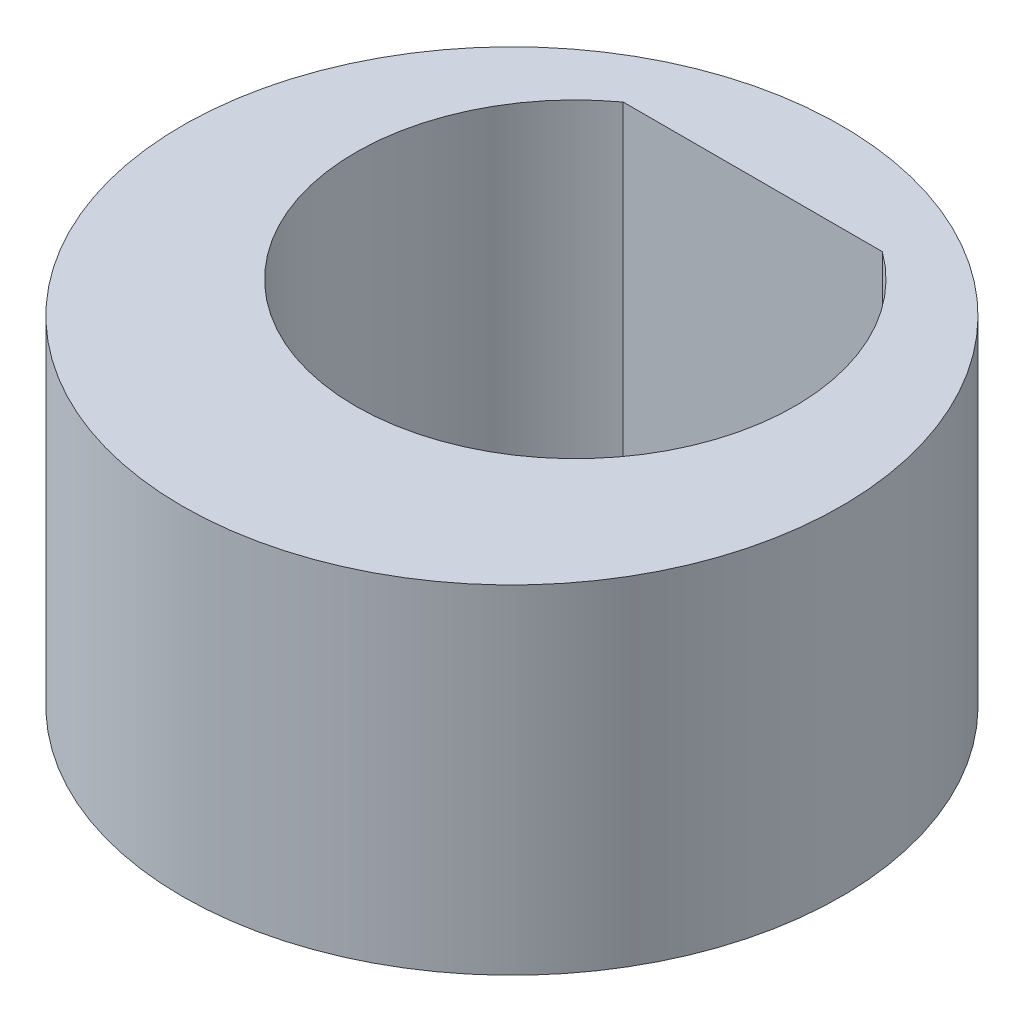
ISO-10303-21;
HEADER;
FILE_DESCRIPTION(('STEP AP214'),'2;1');
FILE_NAME('part.step','',(''),(''),'','','');
FILE_SCHEMA(('AUTOMOTIVE_DESIGN { 1 0 10303 214 1 1 1 1 }'));
ENDSEC;
DATA;
#1=APPLICATION_CONTEXT('core data for automotive mechanical design processes');
#2=APPLICATION_PROTOCOL_DEFINITION('international standard','automotive_design',2000,#1);
#3=PRODUCT_CONTEXT('',#1,'mechanical');
#4=PRODUCT('Part','Part','',(#3));
#5=PRODUCT_RELATED_PRODUCT_CATEGORY('part','',(#4));
#6=PRODUCT_DEFINITION_FORMATION('','',#4);
#7=PRODUCT_DEFINITION_CONTEXT('part definition',#1,'design');
#8=PRODUCT_DEFINITION('design','',#6,#7);
#9=PRODUCT_DEFINITION_SHAPE('','',#8);
#10=(LENGTH_UNIT() NAMED_UNIT(*) SI_UNIT(.MILLI.,.METRE.));
#11=(NAMED_UNIT(*) PLANE_ANGLE_UNIT() SI_UNIT($,.RADIAN.));
#12=(NAMED_UNIT(*) SI_UNIT($,.STERADIAN.) SOLID_ANGLE_UNIT());
#13=UNCERTAINTY_MEASURE_WITH_UNIT(LENGTH_MEASURE(1.E-05),#10,'distance_accuracy_value','');
#14=(GEOMETRIC_REPRESENTATION_CONTEXT(3) GLOBAL_UNCERTAINTY_ASSIGNED_CONTEXT((#13)) GLOBAL_UNIT_ASSIGNED_CONTEXT((#10,
#11,#12)) REPRESENTATION_CONTEXT('',''));
#15=CARTESIAN_POINT('',(0.,0.,0.));
#16=DIRECTION('',(0.,0.,1.));
#17=DIRECTION('',(1.,0.,0.));
#18=AXIS2_PLACEMENT_3D('',#15,#16,#17);
#19=CARTESIAN_POINT('',(0.,4.,0.75));
#20=DIRECTION('',(0.,1.,0.));
#21=DIRECTION('',(0.,0.,1.));
#22=AXIS2_PLACEMENT_3D('',#19,#20,#21);
#23=PLANE('',#22);
#24=CARTESIAN_POINT('',(0.,4.,0.75));
#25=DIRECTION('',(0.,1.,0.));
#26=DIRECTION('',(0.,0.,1.));
#27=AXIS2_PLACEMENT_3D('',#24,#25,#26);
#28=CIRCLE('',#27,3.9);
#29=CARTESIAN_POINT('',(0.,4.,4.65));
#30=VERTEX_POINT('',#29);
#31=EDGE_CURVE('E11',#30,#30,#28,.T.);
#32=ORIENTED_EDGE('',*,*,#31,.T.);
#33=EDGE_LOOP('',(#32));
#34=FACE_BOUND('',#33,.T.);
#35=DIRECTION('',(-1.,0.,0.));
#36=VECTOR('',#35,1.);
#37=CARTESIAN_POINT('',(-1.53297097167559,4.,-2.1));
#38=LINE('',#37,#36);
#39=CARTESIAN_POINT('',(1.53297097167559,4.,-2.1));
#40=VERTEX_POINT('',#39);
#41=CARTESIAN_POINT('',(-1.53297097167559,4.,-2.1));
#42=VERTEX_POINT('',#41);
#43=EDGE_CURVE('E85',#40,#42,#38,.T.);
#44=ORIENTED_EDGE('',*,*,#43,.F.);
#45=CARTESIAN_POINT('',(0.,4.,0.));
#46=DIRECTION('',(0.,1.,0.));
#47=DIRECTION('',(0.,0.,1.));
#48=AXIS2_PLACEMENT_3D('',#45,#46,#47);
#49=CIRCLE('',#48,2.6);
#50=EDGE_CURVE('E74',#42,#40,#49,.T.);
#51=ORIENTED_EDGE('',*,*,#50,.F.);
#52=EDGE_LOOP('',(#44,#51));
#53=FACE_BOUND('',#52,.T.);
#54=ADVANCED_FACE('F40',(#34,#53),#23,.T.);
#55=CARTESIAN_POINT('',(0.,0.,0.75));
#56=DIRECTION('',(0.,1.,0.));
#57=DIRECTION('',(0.,0.,1.));
#58=AXIS2_PLACEMENT_3D('',#55,#56,#57);
#59=PLANE('',#58);
#60=CARTESIAN_POINT('',(0.,0.,0.75));
#61=DIRECTION('',(0.,1.,0.));
#62=DIRECTION('',(0.,0.,1.));
#63=AXIS2_PLACEMENT_3D('',#60,#61,#62);
#64=CIRCLE('',#63,3.9);
#65=CARTESIAN_POINT('',(0.,0.,4.65));
#66=VERTEX_POINT('',#65);
#67=EDGE_CURVE('E44',#66,#66,#64,.T.);
#68=ORIENTED_EDGE('',*,*,#67,.F.);
#69=EDGE_LOOP('',(#68));
#70=FACE_BOUND('',#69,.T.);
#71=CARTESIAN_POINT('',(0.,0.,0.));
#72=DIRECTION('',(0.,1.,0.));
#73=DIRECTION('',(0.,0.,1.));
#74=AXIS2_PLACEMENT_3D('',#71,#72,#73);
#75=CIRCLE('',#74,2.6);
#76=CARTESIAN_POINT('',(-1.53297097167559,0.,-2.1));
#77=VERTEX_POINT('',#76);
#78=CARTESIAN_POINT('',(1.53297097167559,0.,-2.1));
#79=VERTEX_POINT('',#78);
#80=EDGE_CURVE('E63',#77,#79,#75,.T.);
#81=ORIENTED_EDGE('',*,*,#80,.T.);
#82=DIRECTION('',(-1.,0.,0.));
#83=VECTOR('',#82,1.);
#84=CARTESIAN_POINT('',(-1.53297097167559,0.,-2.1));
#85=LINE('',#84,#83);
#86=EDGE_CURVE('E69',#79,#77,#85,.T.);
#87=ORIENTED_EDGE('',*,*,#86,.T.);
#88=EDGE_LOOP('',(#81,#87));
#89=FACE_BOUND('',#88,.T.);
#90=ADVANCED_FACE('F81',(#70,#89),#59,.F.);
#91=CARTESIAN_POINT('',(0.,4.,0.75));
#92=DIRECTION('',(0.,-1.,0.));
#93=DIRECTION('',(0.,0.,-1.));
#94=AXIS2_PLACEMENT_3D('',#91,#92,#93);
#95=CYLINDRICAL_SURFACE('',#94,3.9);
#96=ORIENTED_EDGE('',*,*,#31,.F.);
#97=EDGE_LOOP('',(#96));
#98=FACE_BOUND('',#97,.T.);
#99=ORIENTED_EDGE('',*,*,#67,.T.);
#100=EDGE_LOOP('',(#99));
#101=FACE_BOUND('',#100,.T.);
#102=ADVANCED_FACE('F42',(#98,#101),#95,.T.);
#103=CARTESIAN_POINT('',(0.,4.,0.));
#104=DIRECTION('',(0.,-1.,0.));
#105=DIRECTION('',(0.,0.,-1.));
#106=AXIS2_PLACEMENT_3D('',#103,#104,#105);
#107=CYLINDRICAL_SURFACE('',#106,2.6);
#108=ORIENTED_EDGE('',*,*,#80,.F.);
#109=DIRECTION('',(0.,-1.,0.));
#110=VECTOR('',#109,1.);
#111=CARTESIAN_POINT('',(-1.53297097167559,4.,-2.1));
#112=LINE('',#111,#110);
#113=EDGE_CURVE('E71',#42,#77,#112,.T.);
#114=ORIENTED_EDGE('',*,*,#113,.F.);
#115=ORIENTED_EDGE('',*,*,#50,.T.);
#116=DIRECTION('',(0.,-1.,0.));
#117=VECTOR('',#116,1.);
#118=CARTESIAN_POINT('',(1.53297097167559,4.,-2.1));
#119=LINE('',#118,#117);
#120=EDGE_CURVE('E56',#40,#79,#119,.T.);
#121=ORIENTED_EDGE('',*,*,#120,.T.);
#122=EDGE_LOOP('',(#108,#114,#115,#121));
#123=FACE_BOUND('',#122,.T.);
#124=ADVANCED_FACE('F76',(#123),#107,.F.);
#125=CARTESIAN_POINT('',(-1.53297097167559,4.,-2.1));
#126=DIRECTION('',(0.,0.,1.));
#127=DIRECTION('',(1.,0.,0.));
#128=AXIS2_PLACEMENT_3D('',#125,#126,#127);
#129=PLANE('',#128);
#130=ORIENTED_EDGE('',*,*,#86,.F.);
#131=ORIENTED_EDGE('',*,*,#120,.F.);
#132=ORIENTED_EDGE('',*,*,#43,.T.);
#133=ORIENTED_EDGE('',*,*,#113,.T.);
#134=EDGE_LOOP('',(#130,#131,#132,#133));
#135=FACE_BOUND('',#134,.T.);
#136=ADVANCED_FACE('F70',(#135),#129,.T.);
#137=CLOSED_SHELL('',(#54,#90,#102,#124,#136));
#138=MANIFOLD_SOLID_BREP('B2',#137);
#139=ADVANCED_BREP_SHAPE_REPRESENTATION('',(#18,#138),#14);
#140=SHAPE_DEFINITION_REPRESENTATION(#9,#139);
ENDSEC;
END-ISO-10303-21;
